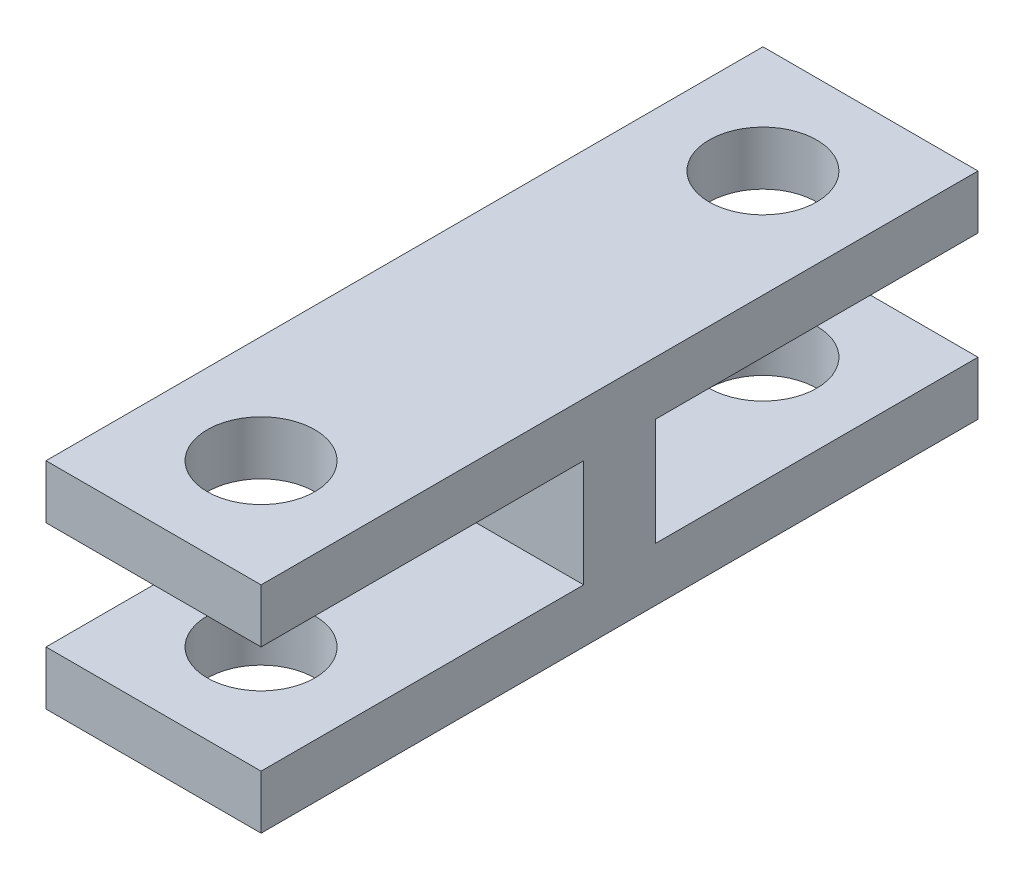
ISO-10303-21;
HEADER;
FILE_DESCRIPTION(('STEP AP214'),'2;1');
FILE_NAME('part.step','',(''),(''),'','','');
FILE_SCHEMA(('AUTOMOTIVE_DESIGN { 1 0 10303 214 1 1 1 1 }'));
ENDSEC;
DATA;
#1=APPLICATION_CONTEXT('core data for automotive mechanical design processes');
#2=APPLICATION_PROTOCOL_DEFINITION('international standard','automotive_design',2000,#1);
#3=PRODUCT_CONTEXT('',#1,'mechanical');
#4=PRODUCT('Part','Part','',(#3));
#5=PRODUCT_RELATED_PRODUCT_CATEGORY('part','',(#4));
#6=PRODUCT_DEFINITION_FORMATION('','',#4);
#7=PRODUCT_DEFINITION_CONTEXT('part definition',#1,'design');
#8=PRODUCT_DEFINITION('design','',#6,#7);
#9=PRODUCT_DEFINITION_SHAPE('','',#8);
#10=(LENGTH_UNIT() NAMED_UNIT(*) SI_UNIT(.MILLI.,.METRE.));
#11=(NAMED_UNIT(*) PLANE_ANGLE_UNIT() SI_UNIT($,.RADIAN.));
#12=(NAMED_UNIT(*) SI_UNIT($,.STERADIAN.) SOLID_ANGLE_UNIT());
#13=UNCERTAINTY_MEASURE_WITH_UNIT(LENGTH_MEASURE(1.E-05),#10,'distance_accuracy_value','');
#14=(GEOMETRIC_REPRESENTATION_CONTEXT(3) GLOBAL_UNCERTAINTY_ASSIGNED_CONTEXT((#13)) GLOBAL_UNIT_ASSIGNED_CONTEXT((#10,
#11,#12)) REPRESENTATION_CONTEXT('',''));
#15=CARTESIAN_POINT('',(0.,0.,0.));
#16=DIRECTION('',(0.,0.,1.));
#17=DIRECTION('',(1.,0.,0.));
#18=AXIS2_PLACEMENT_3D('',#15,#16,#17);
#19=CARTESIAN_POINT('',(6.,-10.1082403100063,4.58186139778075));
#20=DIRECTION('',(0.,0.,-1.));
#21=DIRECTION('',(0.,1.,0.));
#22=AXIS2_PLACEMENT_3D('',#19,#20,#21);
#23=PLANE('',#22);
#24=DIRECTION('',(0.,-1.,0.));
#25=VECTOR('',#24,1.);
#26=CARTESIAN_POINT('',(0.,-10.1082403100063,4.58186139778075));
#27=LINE('',#26,#25);
#28=CARTESIAN_POINT('',(0.,-8.60824031000633,4.58186139778075));
#29=VERTEX_POINT('',#28);
#30=CARTESIAN_POINT('',(0.,-10.1082403100063,4.58186139778075));
#31=VERTEX_POINT('',#30);
#32=EDGE_CURVE('E153',#29,#31,#27,.T.);
#33=ORIENTED_EDGE('',*,*,#32,.T.);
#34=DIRECTION('',(-1.,0.,0.));
#35=VECTOR('',#34,1.);
#36=CARTESIAN_POINT('',(6.,-10.1082403100063,4.58186139778075));
#37=LINE('',#36,#35);
#38=CARTESIAN_POINT('',(6.,-10.1082403100063,4.58186139778075));
#39=VERTEX_POINT('',#38);
#40=EDGE_CURVE('E11',#39,#31,#37,.T.);
#41=ORIENTED_EDGE('',*,*,#40,.F.);
#42=DIRECTION('',(0.,-1.,0.));
#43=VECTOR('',#42,1.);
#44=CARTESIAN_POINT('',(6.,-10.1082403100063,4.58186139778075));
#45=LINE('',#44,#43);
#46=CARTESIAN_POINT('',(6.,-8.60824031000633,4.58186139778075));
#47=VERTEX_POINT('',#46);
#48=EDGE_CURVE('E176',#47,#39,#45,.T.);
#49=ORIENTED_EDGE('',*,*,#48,.F.);
#50=DIRECTION('',(-1.,0.,0.));
#51=VECTOR('',#50,1.);
#52=CARTESIAN_POINT('',(6.,-8.60824031000633,4.58186139778075));
#53=LINE('',#52,#51);
#54=EDGE_CURVE('E149',#47,#29,#53,.T.);
#55=ORIENTED_EDGE('',*,*,#54,.T.);
#56=EDGE_LOOP('',(#33,#41,#49,#55));
#57=FACE_BOUND('',#56,.T.);
#58=ADVANCED_FACE('F32',(#57),#23,.F.);
#59=CARTESIAN_POINT('',(6.,-10.1082403100063,-15.4181386022193));
#60=DIRECTION('',(0.,1.,0.));
#61=DIRECTION('',(0.,0.,1.));
#62=AXIS2_PLACEMENT_3D('',#59,#60,#61);
#63=PLANE('',#62);
#64=CARTESIAN_POINT('',(3.,-10.1082403100063,1.58186139778075));
#65=DIRECTION('',(0.,1.,0.));
#66=DIRECTION('',(0.,0.,1.));
#67=AXIS2_PLACEMENT_3D('',#64,#65,#66);
#68=CIRCLE('',#67,1.5);
#69=CARTESIAN_POINT('',(3.,-10.1082403100063,3.08186139778075));
#70=VERTEX_POINT('',#69);
#71=EDGE_CURVE('E299',#70,#70,#68,.T.);
#72=ORIENTED_EDGE('',*,*,#71,.T.);
#73=EDGE_LOOP('',(#72));
#74=FACE_BOUND('',#73,.T.);
#75=CARTESIAN_POINT('',(3.,-10.1082403100063,-12.4181386022192));
#76=DIRECTION('',(0.,1.,0.));
#77=DIRECTION('',(0.,0.,1.));
#78=AXIS2_PLACEMENT_3D('',#75,#76,#77);
#79=CIRCLE('',#78,1.5);
#80=CARTESIAN_POINT('',(3.,-10.1082403100063,-10.9181386022192));
#81=VERTEX_POINT('',#80);
#82=EDGE_CURVE('E337',#81,#81,#79,.T.);
#83=ORIENTED_EDGE('',*,*,#82,.T.);
#84=EDGE_LOOP('',(#83));
#85=FACE_BOUND('',#84,.T.);
#86=DIRECTION('',(0.,0.,-1.));
#87=VECTOR('',#86,1.);
#88=CARTESIAN_POINT('',(0.,-10.1082403100063,-15.4181386022193));
#89=LINE('',#88,#87);
#90=CARTESIAN_POINT('',(0.,-10.1082403100063,-15.4181386022193));
#91=VERTEX_POINT('',#90);
#92=EDGE_CURVE('E156',#31,#91,#89,.T.);
#93=ORIENTED_EDGE('',*,*,#92,.T.);
#94=DIRECTION('',(-1.,0.,0.));
#95=VECTOR('',#94,1.);
#96=CARTESIAN_POINT('',(6.,-10.1082403100063,-15.4181386022193));
#97=LINE('',#96,#95);
#98=CARTESIAN_POINT('',(6.,-10.1082403100063,-15.4181386022193));
#99=VERTEX_POINT('',#98);
#100=EDGE_CURVE('E41',#99,#91,#97,.T.);
#101=ORIENTED_EDGE('',*,*,#100,.F.);
#102=DIRECTION('',(0.,0.,-1.));
#103=VECTOR('',#102,1.);
#104=CARTESIAN_POINT('',(6.,-10.1082403100063,-15.4181386022193));
#105=LINE('',#104,#103);
#106=EDGE_CURVE('E104',#39,#99,#105,.T.);
#107=ORIENTED_EDGE('',*,*,#106,.F.);
#108=ORIENTED_EDGE('',*,*,#40,.T.);
#109=EDGE_LOOP('',(#93,#101,#107,#108));
#110=FACE_BOUND('',#109,.T.);
#111=ADVANCED_FACE('F257',(#74,#85,#110),#63,.F.);
#112=CARTESIAN_POINT('',(6.,-8.60824031000633,-15.4181386022193));
#113=DIRECTION('',(0.,0.,1.));
#114=DIRECTION('',(0.,-1.,0.));
#115=AXIS2_PLACEMENT_3D('',#112,#113,#114);
#116=PLANE('',#115);
#117=DIRECTION('',(0.,1.,0.));
#118=VECTOR('',#117,1.);
#119=CARTESIAN_POINT('',(0.,-8.60824031000633,-15.4181386022193));
#120=LINE('',#119,#118);
#121=CARTESIAN_POINT('',(0.,-8.60824031000633,-15.4181386022193));
#122=VERTEX_POINT('',#121);
#123=EDGE_CURVE('E159',#91,#122,#120,.T.);
#124=ORIENTED_EDGE('',*,*,#123,.T.);
#125=DIRECTION('',(-1.,0.,0.));
#126=VECTOR('',#125,1.);
#127=CARTESIAN_POINT('',(6.,-8.60824031000633,-15.4181386022193));
#128=LINE('',#127,#126);
#129=CARTESIAN_POINT('',(6.,-8.60824031000633,-15.4181386022193));
#130=VERTEX_POINT('',#129);
#131=EDGE_CURVE('E195',#130,#122,#128,.T.);
#132=ORIENTED_EDGE('',*,*,#131,.F.);
#133=DIRECTION('',(0.,1.,0.));
#134=VECTOR('',#133,1.);
#135=CARTESIAN_POINT('',(6.,-8.60824031000633,-15.4181386022193));
#136=LINE('',#135,#134);
#137=EDGE_CURVE('E204',#99,#130,#136,.T.);
#138=ORIENTED_EDGE('',*,*,#137,.F.);
#139=ORIENTED_EDGE('',*,*,#100,.T.);
#140=EDGE_LOOP('',(#124,#132,#138,#139));
#141=FACE_BOUND('',#140,.T.);
#142=ADVANCED_FACE('F202',(#141),#116,.F.);
#143=CARTESIAN_POINT('',(6.,-8.60824031000633,-6.41813860221925));
#144=DIRECTION('',(0.,-1.,0.));
#145=DIRECTION('',(0.,0.,-1.));
#146=AXIS2_PLACEMENT_3D('',#143,#144,#145);
#147=PLANE('',#146);
#148=CARTESIAN_POINT('',(3.,-8.60824031000633,-12.4181386022192));
#149=DIRECTION('',(0.,-1.,0.));
#150=DIRECTION('',(0.,0.,-1.));
#151=AXIS2_PLACEMENT_3D('',#148,#149,#150);
#152=CIRCLE('',#151,1.5);
#153=CARTESIAN_POINT('',(3.,-8.60824031000633,-13.9181386022192));
#154=VERTEX_POINT('',#153);
#155=EDGE_CURVE('E157',#154,#154,#152,.T.);
#156=ORIENTED_EDGE('',*,*,#155,.T.);
#157=EDGE_LOOP('',(#156));
#158=FACE_BOUND('',#157,.T.);
#159=DIRECTION('',(0.,0.,1.));
#160=VECTOR('',#159,1.);
#161=CARTESIAN_POINT('',(0.,-8.60824031000633,-6.41813860221925));
#162=LINE('',#161,#160);
#163=CARTESIAN_POINT('',(0.,-8.60824031000633,-6.41813860221925));
#164=VERTEX_POINT('',#163);
#165=EDGE_CURVE('E161',#122,#164,#162,.T.);
#166=ORIENTED_EDGE('',*,*,#165,.T.);
#167=DIRECTION('',(-1.,0.,0.));
#168=VECTOR('',#167,1.);
#169=CARTESIAN_POINT('',(6.,-8.60824031000633,-6.41813860221925));
#170=LINE('',#169,#168);
#171=CARTESIAN_POINT('',(6.,-8.60824031000633,-6.41813860221925));
#172=VERTEX_POINT('',#171);
#173=EDGE_CURVE('E192',#172,#164,#170,.T.);
#174=ORIENTED_EDGE('',*,*,#173,.F.);
#175=DIRECTION('',(0.,0.,1.));
#176=VECTOR('',#175,1.);
#177=CARTESIAN_POINT('',(6.,-8.60824031000633,-6.41813860221925));
#178=LINE('',#177,#176);
#179=EDGE_CURVE('E222',#130,#172,#178,.T.);
#180=ORIENTED_EDGE('',*,*,#179,.F.);
#181=ORIENTED_EDGE('',*,*,#131,.T.);
#182=EDGE_LOOP('',(#166,#174,#180,#181));
#183=FACE_BOUND('',#182,.T.);
#184=ADVANCED_FACE('F213',(#158,#183),#147,.F.);
#185=CARTESIAN_POINT('',(6.,-5.60824031000633,-6.41813860221925));
#186=DIRECTION('',(0.,0.,1.));
#187=DIRECTION('',(1.,0.,0.));
#188=AXIS2_PLACEMENT_3D('',#185,#186,#187);
#189=PLANE('',#188);
#190=DIRECTION('',(0.,1.,0.));
#191=VECTOR('',#190,1.);
#192=CARTESIAN_POINT('',(0.,-5.60824031000633,-6.41813860221925));
#193=LINE('',#192,#191);
#194=CARTESIAN_POINT('',(0.,-5.60824031000633,-6.41813860221925));
#195=VERTEX_POINT('',#194);
#196=EDGE_CURVE('E163',#164,#195,#193,.T.);
#197=ORIENTED_EDGE('',*,*,#196,.T.);
#198=DIRECTION('',(-1.,0.,0.));
#199=VECTOR('',#198,1.);
#200=CARTESIAN_POINT('',(6.,-5.60824031000633,-6.41813860221925));
#201=LINE('',#200,#199);
#202=CARTESIAN_POINT('',(6.,-5.60824031000633,-6.41813860221925));
#203=VERTEX_POINT('',#202);
#204=EDGE_CURVE('E189',#203,#195,#201,.T.);
#205=ORIENTED_EDGE('',*,*,#204,.F.);
#206=DIRECTION('',(0.,1.,0.));
#207=VECTOR('',#206,1.);
#208=CARTESIAN_POINT('',(6.,-5.60824031000633,-6.41813860221925));
#209=LINE('',#208,#207);
#210=EDGE_CURVE('E219',#172,#203,#209,.T.);
#211=ORIENTED_EDGE('',*,*,#210,.F.);
#212=ORIENTED_EDGE('',*,*,#173,.T.);
#213=EDGE_LOOP('',(#197,#205,#211,#212));
#214=FACE_BOUND('',#213,.T.);
#215=ADVANCED_FACE('F217',(#214),#189,.F.);
#216=CARTESIAN_POINT('',(6.,-5.60824031000633,-15.4181386022193));
#217=DIRECTION('',(0.,1.,0.));
#218=DIRECTION('',(0.,0.,1.));
#219=AXIS2_PLACEMENT_3D('',#216,#217,#218);
#220=PLANE('',#219);
#221=CARTESIAN_POINT('',(3.,-5.60824031000633,-12.4181386022192));
#222=DIRECTION('',(0.,1.,0.));
#223=DIRECTION('',(0.,0.,1.));
#224=AXIS2_PLACEMENT_3D('',#221,#222,#223);
#225=CIRCLE('',#224,1.5);
#226=CARTESIAN_POINT('',(3.,-5.60824031000633,-10.9181386022192));
#227=VERTEX_POINT('',#226);
#228=EDGE_CURVE('E295',#227,#227,#225,.T.);
#229=ORIENTED_EDGE('',*,*,#228,.T.);
#230=EDGE_LOOP('',(#229));
#231=FACE_BOUND('',#230,.T.);
#232=DIRECTION('',(0.,0.,-1.));
#233=VECTOR('',#232,1.);
#234=CARTESIAN_POINT('',(0.,-5.60824031000633,-15.4181386022193));
#235=LINE('',#234,#233);
#236=CARTESIAN_POINT('',(0.,-5.60824031000633,-15.4181386022193));
#237=VERTEX_POINT('',#236);
#238=EDGE_CURVE('E165',#195,#237,#235,.T.);
#239=ORIENTED_EDGE('',*,*,#238,.T.);
#240=DIRECTION('',(-1.,0.,0.));
#241=VECTOR('',#240,1.);
#242=CARTESIAN_POINT('',(6.,-5.60824031000633,-15.4181386022193));
#243=LINE('',#242,#241);
#244=CARTESIAN_POINT('',(6.,-5.60824031000633,-15.4181386022193));
#245=VERTEX_POINT('',#244);
#246=EDGE_CURVE('E186',#245,#237,#243,.T.);
#247=ORIENTED_EDGE('',*,*,#246,.F.);
#248=DIRECTION('',(0.,0.,-1.));
#249=VECTOR('',#248,1.);
#250=CARTESIAN_POINT('',(6.,-5.60824031000633,-15.4181386022193));
#251=LINE('',#250,#249);
#252=EDGE_CURVE('E221',#203,#245,#251,.T.);
#253=ORIENTED_EDGE('',*,*,#252,.F.);
#254=ORIENTED_EDGE('',*,*,#204,.T.);
#255=EDGE_LOOP('',(#239,#247,#253,#254));
#256=FACE_BOUND('',#255,.T.);
#257=ADVANCED_FACE('F274',(#231,#256),#220,.F.);
#258=CARTESIAN_POINT('',(6.,-4.10824031000633,-15.4181386022192));
#259=DIRECTION('',(0.,0.,1.));
#260=DIRECTION('',(0.,-1.,0.));
#261=AXIS2_PLACEMENT_3D('',#258,#259,#260);
#262=PLANE('',#261);
#263=DIRECTION('',(0.,1.,0.));
#264=VECTOR('',#263,1.);
#265=CARTESIAN_POINT('',(0.,-4.10824031000633,-15.4181386022192));
#266=LINE('',#265,#264);
#267=CARTESIAN_POINT('',(0.,-4.10824031000633,-15.4181386022192));
#268=VERTEX_POINT('',#267);
#269=EDGE_CURVE('E167',#237,#268,#266,.T.);
#270=ORIENTED_EDGE('',*,*,#269,.T.);
#271=DIRECTION('',(-1.,0.,0.));
#272=VECTOR('',#271,1.);
#273=CARTESIAN_POINT('',(6.,-4.10824031000633,-15.4181386022192));
#274=LINE('',#273,#272);
#275=CARTESIAN_POINT('',(6.,-4.10824031000633,-15.4181386022192));
#276=VERTEX_POINT('',#275);
#277=EDGE_CURVE('E183',#276,#268,#274,.T.);
#278=ORIENTED_EDGE('',*,*,#277,.F.);
#279=DIRECTION('',(0.,1.,0.));
#280=VECTOR('',#279,1.);
#281=CARTESIAN_POINT('',(6.,-4.10824031000633,-15.4181386022192));
#282=LINE('',#281,#280);
#283=EDGE_CURVE('E224',#245,#276,#282,.T.);
#284=ORIENTED_EDGE('',*,*,#283,.F.);
#285=ORIENTED_EDGE('',*,*,#246,.T.);
#286=EDGE_LOOP('',(#270,#278,#284,#285));
#287=FACE_BOUND('',#286,.T.);
#288=ADVANCED_FACE('F277',(#287),#262,.F.);
#289=CARTESIAN_POINT('',(6.,-4.10824031000633,4.58186139778075));
#290=DIRECTION('',(0.,-1.,0.));
#291=DIRECTION('',(0.,0.,-1.));
#292=AXIS2_PLACEMENT_3D('',#289,#290,#291);
#293=PLANE('',#292);
#294=CARTESIAN_POINT('',(3.,-4.10824031000633,1.58186139778075));
#295=DIRECTION('',(0.,1.,0.));
#296=DIRECTION('',(0.,0.,1.));
#297=AXIS2_PLACEMENT_3D('',#294,#295,#296);
#298=CIRCLE('',#297,1.5);
#299=CARTESIAN_POINT('',(3.,-4.10824031000633,3.08186139778075));
#300=VERTEX_POINT('',#299);
#301=EDGE_CURVE('E334',#300,#300,#298,.T.);
#302=ORIENTED_EDGE('',*,*,#301,.F.);
#303=EDGE_LOOP('',(#302));
#304=FACE_BOUND('',#303,.T.);
#305=CARTESIAN_POINT('',(3.,-4.10824031000634,-12.4181386022192));
#306=DIRECTION('',(0.,1.,0.));
#307=DIRECTION('',(0.,0.,1.));
#308=AXIS2_PLACEMENT_3D('',#305,#306,#307);
#309=CIRCLE('',#308,1.5);
#310=CARTESIAN_POINT('',(3.,-4.10824031000634,-10.9181386022192));
#311=VERTEX_POINT('',#310);
#312=EDGE_CURVE('E301',#311,#311,#309,.T.);
#313=ORIENTED_EDGE('',*,*,#312,.F.);
#314=EDGE_LOOP('',(#313));
#315=FACE_BOUND('',#314,.T.);
#316=DIRECTION('',(0.,0.,1.));
#317=VECTOR('',#316,1.);
#318=CARTESIAN_POINT('',(0.,-4.10824031000633,4.58186139778075));
#319=LINE('',#318,#317);
#320=CARTESIAN_POINT('',(0.,-4.10824031000633,4.58186139778075));
#321=VERTEX_POINT('',#320);
#322=EDGE_CURVE('E169',#268,#321,#319,.T.);
#323=ORIENTED_EDGE('',*,*,#322,.T.);
#324=DIRECTION('',(-1.,0.,0.));
#325=VECTOR('',#324,1.);
#326=CARTESIAN_POINT('',(6.,-4.10824031000633,4.58186139778075));
#327=LINE('',#326,#325);
#328=CARTESIAN_POINT('',(6.,-4.10824031000633,4.58186139778075));
#329=VERTEX_POINT('',#328);
#330=EDGE_CURVE('E180',#329,#321,#327,.T.);
#331=ORIENTED_EDGE('',*,*,#330,.F.);
#332=DIRECTION('',(0.,0.,1.));
#333=VECTOR('',#332,1.);
#334=CARTESIAN_POINT('',(6.,-4.10824031000633,4.58186139778075));
#335=LINE('',#334,#333);
#336=EDGE_CURVE('E230',#276,#329,#335,.T.);
#337=ORIENTED_EDGE('',*,*,#336,.F.);
#338=ORIENTED_EDGE('',*,*,#277,.T.);
#339=EDGE_LOOP('',(#323,#331,#337,#338));
#340=FACE_BOUND('',#339,.T.);
#341=ADVANCED_FACE('F236',(#304,#315,#340),#293,.F.);
#342=CARTESIAN_POINT('',(6.,-5.60824031000633,4.58186139778075));
#343=DIRECTION('',(0.,0.,-1.));
#344=DIRECTION('',(0.,1.,0.));
#345=AXIS2_PLACEMENT_3D('',#342,#343,#344);
#346=PLANE('',#345);
#347=DIRECTION('',(0.,-1.,0.));
#348=VECTOR('',#347,1.);
#349=CARTESIAN_POINT('',(0.,-5.60824031000633,4.58186139778075));
#350=LINE('',#349,#348);
#351=CARTESIAN_POINT('',(0.,-5.60824031000633,4.58186139778075));
#352=VERTEX_POINT('',#351);
#353=EDGE_CURVE('E171',#321,#352,#350,.T.);
#354=ORIENTED_EDGE('',*,*,#353,.T.);
#355=DIRECTION('',(-1.,0.,0.));
#356=VECTOR('',#355,1.);
#357=CARTESIAN_POINT('',(6.,-5.60824031000633,4.58186139778075));
#358=LINE('',#357,#356);
#359=CARTESIAN_POINT('',(6.,-5.60824031000633,4.58186139778075));
#360=VERTEX_POINT('',#359);
#361=EDGE_CURVE('E144',#360,#352,#358,.T.);
#362=ORIENTED_EDGE('',*,*,#361,.F.);
#363=DIRECTION('',(0.,-1.,0.));
#364=VECTOR('',#363,1.);
#365=CARTESIAN_POINT('',(6.,-5.60824031000633,4.58186139778075));
#366=LINE('',#365,#364);
#367=EDGE_CURVE('E135',#329,#360,#366,.T.);
#368=ORIENTED_EDGE('',*,*,#367,.F.);
#369=ORIENTED_EDGE('',*,*,#330,.T.);
#370=EDGE_LOOP('',(#354,#362,#368,#369));
#371=FACE_BOUND('',#370,.T.);
#372=ADVANCED_FACE('F240',(#371),#346,.F.);
#373=CARTESIAN_POINT('',(6.,-5.60824031000633,-4.41813860221925));
#374=DIRECTION('',(0.,1.,0.));
#375=DIRECTION('',(0.,0.,1.));
#376=AXIS2_PLACEMENT_3D('',#373,#374,#375);
#377=PLANE('',#376);
#378=CARTESIAN_POINT('',(3.,-5.60824031000633,1.58186139778075));
#379=DIRECTION('',(0.,1.,0.));
#380=DIRECTION('',(0.,0.,1.));
#381=AXIS2_PLACEMENT_3D('',#378,#379,#380);
#382=CIRCLE('',#381,1.5);
#383=CARTESIAN_POINT('',(3.,-5.60824031000633,3.08186139778075));
#384=VERTEX_POINT('',#383);
#385=EDGE_CURVE('E293',#384,#384,#382,.T.);
#386=ORIENTED_EDGE('',*,*,#385,.T.);
#387=EDGE_LOOP('',(#386));
#388=FACE_BOUND('',#387,.T.);
#389=DIRECTION('',(0.,0.,-1.));
#390=VECTOR('',#389,1.);
#391=CARTESIAN_POINT('',(0.,-5.60824031000633,-4.41813860221925));
#392=LINE('',#391,#390);
#393=CARTESIAN_POINT('',(0.,-5.60824031000633,-4.41813860221925));
#394=VERTEX_POINT('',#393);
#395=EDGE_CURVE('E143',#352,#394,#392,.T.);
#396=ORIENTED_EDGE('',*,*,#395,.T.);
#397=DIRECTION('',(-1.,0.,0.));
#398=VECTOR('',#397,1.);
#399=CARTESIAN_POINT('',(6.,-5.60824031000633,-4.41813860221925));
#400=LINE('',#399,#398);
#401=CARTESIAN_POINT('',(6.,-5.60824031000633,-4.41813860221925));
#402=VERTEX_POINT('',#401);
#403=EDGE_CURVE('E140',#402,#394,#400,.T.);
#404=ORIENTED_EDGE('',*,*,#403,.F.);
#405=DIRECTION('',(0.,0.,-1.));
#406=VECTOR('',#405,1.);
#407=CARTESIAN_POINT('',(6.,-5.60824031000633,-4.41813860221925));
#408=LINE('',#407,#406);
#409=EDGE_CURVE('E129',#360,#402,#408,.T.);
#410=ORIENTED_EDGE('',*,*,#409,.F.);
#411=ORIENTED_EDGE('',*,*,#361,.T.);
#412=EDGE_LOOP('',(#396,#404,#410,#411));
#413=FACE_BOUND('',#412,.T.);
#414=ADVANCED_FACE('F141',(#388,#413),#377,.F.);
#415=CARTESIAN_POINT('',(6.,-8.60824031000633,-4.41813860221925));
#416=DIRECTION('',(0.,0.,-1.));
#417=DIRECTION('',(-1.,0.,0.));
#418=AXIS2_PLACEMENT_3D('',#415,#416,#417);
#419=PLANE('',#418);
#420=DIRECTION('',(0.,-1.,0.));
#421=VECTOR('',#420,1.);
#422=CARTESIAN_POINT('',(0.,-8.60824031000633,-4.41813860221925));
#423=LINE('',#422,#421);
#424=CARTESIAN_POINT('',(0.,-8.60824031000633,-4.41813860221925));
#425=VERTEX_POINT('',#424);
#426=EDGE_CURVE('E90',#394,#425,#423,.T.);
#427=ORIENTED_EDGE('',*,*,#426,.T.);
#428=DIRECTION('',(-1.,0.,0.));
#429=VECTOR('',#428,1.);
#430=CARTESIAN_POINT('',(6.,-8.60824031000633,-4.41813860221925));
#431=LINE('',#430,#429);
#432=CARTESIAN_POINT('',(6.,-8.60824031000633,-4.41813860221925));
#433=VERTEX_POINT('',#432);
#434=EDGE_CURVE('E145',#433,#425,#431,.T.);
#435=ORIENTED_EDGE('',*,*,#434,.F.);
#436=DIRECTION('',(0.,-1.,0.));
#437=VECTOR('',#436,1.);
#438=CARTESIAN_POINT('',(6.,-8.60824031000633,-4.41813860221925));
#439=LINE('',#438,#437);
#440=EDGE_CURVE('E133',#402,#433,#439,.T.);
#441=ORIENTED_EDGE('',*,*,#440,.F.);
#442=ORIENTED_EDGE('',*,*,#403,.T.);
#443=EDGE_LOOP('',(#427,#435,#441,#442));
#444=FACE_BOUND('',#443,.T.);
#445=ADVANCED_FACE('F147',(#444),#419,.F.);
#446=CARTESIAN_POINT('',(6.,-8.60824031000633,4.58186139778075));
#447=DIRECTION('',(0.,-1.,0.));
#448=DIRECTION('',(0.,0.,-1.));
#449=AXIS2_PLACEMENT_3D('',#446,#447,#448);
#450=PLANE('',#449);
#451=CARTESIAN_POINT('',(3.,-8.60824031000633,1.58186139778075));
#452=DIRECTION('',(0.,-1.,0.));
#453=DIRECTION('',(0.,0.,-1.));
#454=AXIS2_PLACEMENT_3D('',#451,#452,#453);
#455=CIRCLE('',#454,1.5);
#456=CARTESIAN_POINT('',(3.,-8.60824031000633,0.0818613977807501));
#457=VERTEX_POINT('',#456);
#458=EDGE_CURVE('E35',#457,#457,#455,.T.);
#459=ORIENTED_EDGE('',*,*,#458,.T.);
#460=EDGE_LOOP('',(#459));
#461=FACE_BOUND('',#460,.T.);
#462=DIRECTION('',(0.,0.,1.));
#463=VECTOR('',#462,1.);
#464=CARTESIAN_POINT('',(0.,-8.60824031000633,4.58186139778075));
#465=LINE('',#464,#463);
#466=EDGE_CURVE('E96',#425,#29,#465,.T.);
#467=ORIENTED_EDGE('',*,*,#466,.T.);
#468=ORIENTED_EDGE('',*,*,#54,.F.);
#469=DIRECTION('',(0.,0.,1.));
#470=VECTOR('',#469,1.);
#471=CARTESIAN_POINT('',(6.,-8.60824031000633,4.58186139778075));
#472=LINE('',#471,#470);
#473=EDGE_CURVE('E49',#433,#47,#472,.T.);
#474=ORIENTED_EDGE('',*,*,#473,.F.);
#475=ORIENTED_EDGE('',*,*,#434,.T.);
#476=EDGE_LOOP('',(#467,#468,#474,#475));
#477=FACE_BOUND('',#476,.T.);
#478=ADVANCED_FACE('F244',(#461,#477),#450,.F.);
#479=CARTESIAN_POINT('',(6.,0.,0.));
#480=DIRECTION('',(-1.,0.,0.));
#481=DIRECTION('',(0.,0.,1.));
#482=AXIS2_PLACEMENT_3D('',#479,#480,#481);
#483=PLANE('',#482);
#484=ORIENTED_EDGE('',*,*,#48,.T.);
#485=ORIENTED_EDGE('',*,*,#106,.T.);
#486=ORIENTED_EDGE('',*,*,#137,.T.);
#487=ORIENTED_EDGE('',*,*,#179,.T.);
#488=ORIENTED_EDGE('',*,*,#210,.T.);
#489=ORIENTED_EDGE('',*,*,#252,.T.);
#490=ORIENTED_EDGE('',*,*,#283,.T.);
#491=ORIENTED_EDGE('',*,*,#336,.T.);
#492=ORIENTED_EDGE('',*,*,#367,.T.);
#493=ORIENTED_EDGE('',*,*,#409,.T.);
#494=ORIENTED_EDGE('',*,*,#440,.T.);
#495=ORIENTED_EDGE('',*,*,#473,.T.);
#496=EDGE_LOOP('',(#484,#485,#486,#487,#488,#489,#490,#491,#492,#493,#494,#495));
#497=FACE_BOUND('',#496,.T.);
#498=ADVANCED_FACE('F131',(#497),#483,.F.);
#499=CARTESIAN_POINT('',(0.,0.,0.));
#500=DIRECTION('',(-1.,0.,0.));
#501=DIRECTION('',(0.,0.,1.));
#502=AXIS2_PLACEMENT_3D('',#499,#500,#501);
#503=PLANE('',#502);
#504=ORIENTED_EDGE('',*,*,#32,.F.);
#505=ORIENTED_EDGE('',*,*,#466,.F.);
#506=ORIENTED_EDGE('',*,*,#426,.F.);
#507=ORIENTED_EDGE('',*,*,#395,.F.);
#508=ORIENTED_EDGE('',*,*,#353,.F.);
#509=ORIENTED_EDGE('',*,*,#322,.F.);
#510=ORIENTED_EDGE('',*,*,#269,.F.);
#511=ORIENTED_EDGE('',*,*,#238,.F.);
#512=ORIENTED_EDGE('',*,*,#196,.F.);
#513=ORIENTED_EDGE('',*,*,#165,.F.);
#514=ORIENTED_EDGE('',*,*,#123,.F.);
#515=ORIENTED_EDGE('',*,*,#92,.F.);
#516=EDGE_LOOP('',(#504,#505,#506,#507,#508,#509,#510,#511,#512,#513,#514,#515));
#517=FACE_BOUND('',#516,.T.);
#518=ADVANCED_FACE('F208',(#517),#503,.T.);
#519=CARTESIAN_POINT('',(3.,-10.1082403100063,1.58186139778075));
#520=DIRECTION('',(0.,1.,0.));
#521=DIRECTION('',(0.,0.,1.));
#522=AXIS2_PLACEMENT_3D('',#519,#520,#521);
#523=CYLINDRICAL_SURFACE('',#522,1.5);
#524=ORIENTED_EDGE('',*,*,#71,.F.);
#525=EDGE_LOOP('',(#524));
#526=FACE_BOUND('',#525,.T.);
#527=ORIENTED_EDGE('',*,*,#458,.F.);
#528=EDGE_LOOP('',(#527));
#529=FACE_BOUND('',#528,.T.);
#530=ADVANCED_FACE('F322',(#526,#529),#523,.F.);
#531=ORIENTED_EDGE('',*,*,#301,.T.);
#532=EDGE_LOOP('',(#531));
#533=FACE_BOUND('',#532,.T.);
#534=ORIENTED_EDGE('',*,*,#385,.F.);
#535=EDGE_LOOP('',(#534));
#536=FACE_BOUND('',#535,.T.);
#537=ADVANCED_FACE('F317',(#533,#536),#523,.F.);
#538=CARTESIAN_POINT('',(3.,-10.1082403100063,-12.4181386022192));
#539=DIRECTION('',(0.,1.,0.));
#540=DIRECTION('',(0.,0.,1.));
#541=AXIS2_PLACEMENT_3D('',#538,#539,#540);
#542=CYLINDRICAL_SURFACE('',#541,1.5);
#543=ORIENTED_EDGE('',*,*,#312,.T.);
#544=EDGE_LOOP('',(#543));
#545=FACE_BOUND('',#544,.T.);
#546=ORIENTED_EDGE('',*,*,#228,.F.);
#547=EDGE_LOOP('',(#546));
#548=FACE_BOUND('',#547,.T.);
#549=ADVANCED_FACE('F311',(#545,#548),#542,.F.);
#550=ORIENTED_EDGE('',*,*,#82,.F.);
#551=EDGE_LOOP('',(#550));
#552=FACE_BOUND('',#551,.T.);
#553=ORIENTED_EDGE('',*,*,#155,.F.);
#554=EDGE_LOOP('',(#553));
#555=FACE_BOUND('',#554,.T.);
#556=ADVANCED_FACE('F309',(#552,#555),#542,.F.);
#557=CLOSED_SHELL('',(#58,#111,#142,#184,#215,#257,#288,#341,#372,#414,#445,#478,#498,#518,#530,
#537,#549,#556));
#558=MANIFOLD_SOLID_BREP('B2',#557);
#559=ADVANCED_BREP_SHAPE_REPRESENTATION('',(#18,#558),#14);
#560=SHAPE_DEFINITION_REPRESENTATION(#9,#559);
ENDSEC;
END-ISO-10303-21;
